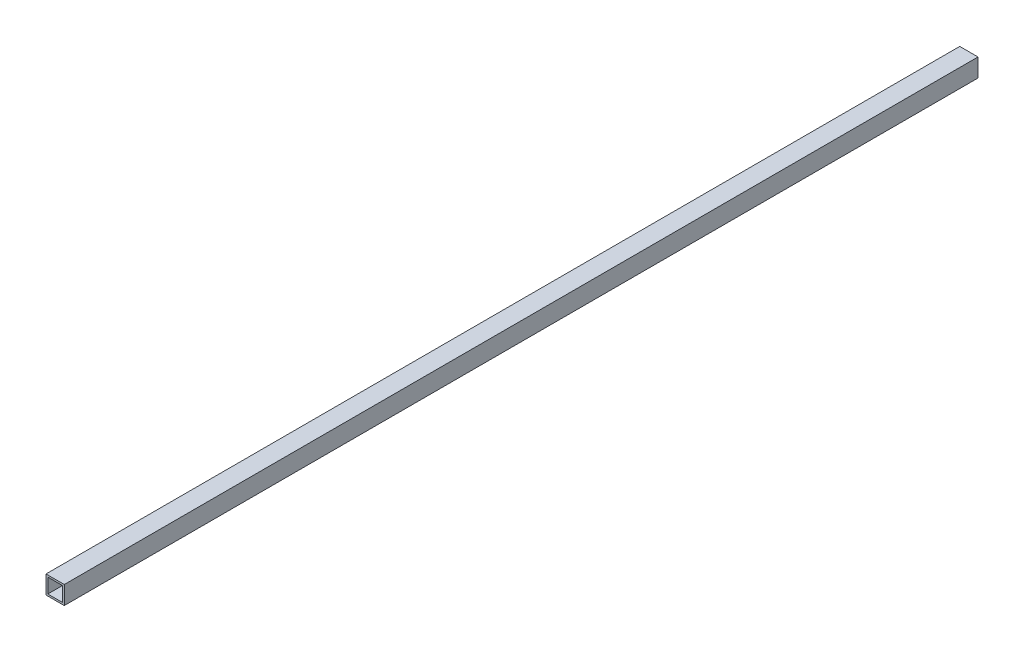
ISO-10303-21;
HEADER;
FILE_DESCRIPTION(('STEP AP214'),'2;1');
FILE_NAME('part.step','',(''),(''),'','','');
FILE_SCHEMA(('AUTOMOTIVE_DESIGN { 1 0 10303 214 1 1 1 1 }'));
ENDSEC;
DATA;
#1=APPLICATION_CONTEXT('core data for automotive mechanical design processes');
#2=APPLICATION_PROTOCOL_DEFINITION('international standard','automotive_design',2000,#1);
#3=PRODUCT_CONTEXT('',#1,'mechanical');
#4=PRODUCT('Part','Part','',(#3));
#5=PRODUCT_RELATED_PRODUCT_CATEGORY('part','',(#4));
#6=PRODUCT_DEFINITION_FORMATION('','',#4);
#7=PRODUCT_DEFINITION_CONTEXT('part definition',#1,'design');
#8=PRODUCT_DEFINITION('design','',#6,#7);
#9=PRODUCT_DEFINITION_SHAPE('','',#8);
#10=(LENGTH_UNIT() NAMED_UNIT(*) SI_UNIT(.MILLI.,.METRE.));
#11=(NAMED_UNIT(*) PLANE_ANGLE_UNIT() SI_UNIT($,.RADIAN.));
#12=(NAMED_UNIT(*) SI_UNIT($,.STERADIAN.) SOLID_ANGLE_UNIT());
#13=UNCERTAINTY_MEASURE_WITH_UNIT(LENGTH_MEASURE(1.E-05),#10,'distance_accuracy_value','');
#14=(GEOMETRIC_REPRESENTATION_CONTEXT(3) GLOBAL_UNCERTAINTY_ASSIGNED_CONTEXT((#13)) GLOBAL_UNIT_ASSIGNED_CONTEXT((#10,
#11,#12)) REPRESENTATION_CONTEXT('',''));
#15=CARTESIAN_POINT('',(0.,0.,0.));
#16=DIRECTION('',(0.,0.,1.));
#17=DIRECTION('',(1.,0.,0.));
#18=AXIS2_PLACEMENT_3D('',#15,#16,#17);
#19=CARTESIAN_POINT('',(0.,0.,-2000.));
#20=DIRECTION('',(-1.,0.,0.));
#21=DIRECTION('',(0.,0.,1.));
#22=AXIS2_PLACEMENT_3D('',#19,#20,#21);
#23=PLANE('',#22);
#24=DIRECTION('',(0.,-1.,0.));
#25=VECTOR('',#24,1.);
#26=CARTESIAN_POINT('',(0.,0.,0.));
#27=LINE('',#26,#25);
#28=CARTESIAN_POINT('',(0.,40.,0.));
#29=VERTEX_POINT('',#28);
#30=CARTESIAN_POINT('',(0.,0.,0.));
#31=VERTEX_POINT('',#30);
#32=EDGE_CURVE('E135',#29,#31,#27,.T.);
#33=ORIENTED_EDGE('',*,*,#32,.F.);
#34=DIRECTION('',(0.,0.,1.));
#35=VECTOR('',#34,1.);
#36=CARTESIAN_POINT('',(0.,40.,-2000.));
#37=LINE('',#36,#35);
#38=CARTESIAN_POINT('',(0.,40.,-2000.));
#39=VERTEX_POINT('',#38);
#40=EDGE_CURVE('E11',#39,#29,#37,.T.);
#41=ORIENTED_EDGE('',*,*,#40,.F.);
#42=DIRECTION('',(0.,-1.,0.));
#43=VECTOR('',#42,1.);
#44=CARTESIAN_POINT('',(0.,0.,-2000.));
#45=LINE('',#44,#43);
#46=CARTESIAN_POINT('',(0.,0.,-2000.));
#47=VERTEX_POINT('',#46);
#48=EDGE_CURVE('E139',#39,#47,#45,.T.);
#49=ORIENTED_EDGE('',*,*,#48,.T.);
#50=DIRECTION('',(0.,0.,1.));
#51=VECTOR('',#50,1.);
#52=CARTESIAN_POINT('',(0.,0.,-2000.));
#53=LINE('',#52,#51);
#54=EDGE_CURVE('E40',#47,#31,#53,.T.);
#55=ORIENTED_EDGE('',*,*,#54,.T.);
#56=EDGE_LOOP('',(#33,#41,#49,#55));
#57=FACE_BOUND('',#56,.T.);
#58=ADVANCED_FACE('F37',(#57),#23,.T.);
#59=CARTESIAN_POINT('',(0.,40.,-2000.));
#60=DIRECTION('',(0.,1.,0.));
#61=DIRECTION('',(0.,0.,1.));
#62=AXIS2_PLACEMENT_3D('',#59,#60,#61);
#63=PLANE('',#62);
#64=DIRECTION('',(-1.,0.,0.));
#65=VECTOR('',#64,1.);
#66=CARTESIAN_POINT('',(0.,40.,0.));
#67=LINE('',#66,#65);
#68=CARTESIAN_POINT('',(40.,40.,0.));
#69=VERTEX_POINT('',#68);
#70=EDGE_CURVE('E143',#69,#29,#67,.T.);
#71=ORIENTED_EDGE('',*,*,#70,.F.);
#72=DIRECTION('',(0.,0.,1.));
#73=VECTOR('',#72,1.);
#74=CARTESIAN_POINT('',(40.,40.,-2000.));
#75=LINE('',#74,#73);
#76=CARTESIAN_POINT('',(40.,40.,-2000.));
#77=VERTEX_POINT('',#76);
#78=EDGE_CURVE('E45',#77,#69,#75,.T.);
#79=ORIENTED_EDGE('',*,*,#78,.F.);
#80=DIRECTION('',(-1.,0.,0.));
#81=VECTOR('',#80,1.);
#82=CARTESIAN_POINT('',(0.,40.,-2000.));
#83=LINE('',#82,#81);
#84=EDGE_CURVE('E149',#77,#39,#83,.T.);
#85=ORIENTED_EDGE('',*,*,#84,.T.);
#86=ORIENTED_EDGE('',*,*,#40,.T.);
#87=EDGE_LOOP('',(#71,#79,#85,#86));
#88=FACE_BOUND('',#87,.T.);
#89=ADVANCED_FACE('F175',(#88),#63,.T.);
#90=CARTESIAN_POINT('',(40.,0.,-2000.));
#91=DIRECTION('',(1.,0.,0.));
#92=DIRECTION('',(0.,0.,-1.));
#93=AXIS2_PLACEMENT_3D('',#90,#91,#92);
#94=PLANE('',#93);
#95=DIRECTION('',(0.,1.,0.));
#96=VECTOR('',#95,1.);
#97=CARTESIAN_POINT('',(40.,0.,0.));
#98=LINE('',#97,#96);
#99=CARTESIAN_POINT('',(40.,0.,0.));
#100=VERTEX_POINT('',#99);
#101=EDGE_CURVE('E157',#100,#69,#98,.T.);
#102=ORIENTED_EDGE('',*,*,#101,.F.);
#103=DIRECTION('',(0.,0.,1.));
#104=VECTOR('',#103,1.);
#105=CARTESIAN_POINT('',(40.,0.,-2000.));
#106=LINE('',#105,#104);
#107=CARTESIAN_POINT('',(40.,0.,-2000.));
#108=VERTEX_POINT('',#107);
#109=EDGE_CURVE('E162',#108,#100,#106,.T.);
#110=ORIENTED_EDGE('',*,*,#109,.F.);
#111=DIRECTION('',(0.,1.,0.));
#112=VECTOR('',#111,1.);
#113=CARTESIAN_POINT('',(40.,0.,-2000.));
#114=LINE('',#113,#112);
#115=EDGE_CURVE('E146',#108,#77,#114,.T.);
#116=ORIENTED_EDGE('',*,*,#115,.T.);
#117=ORIENTED_EDGE('',*,*,#78,.T.);
#118=EDGE_LOOP('',(#102,#110,#116,#117));
#119=FACE_BOUND('',#118,.T.);
#120=ADVANCED_FACE('F179',(#119),#94,.T.);
#121=CARTESIAN_POINT('',(0.,0.,-2000.));
#122=DIRECTION('',(0.,-1.,0.));
#123=DIRECTION('',(0.,0.,-1.));
#124=AXIS2_PLACEMENT_3D('',#121,#122,#123);
#125=PLANE('',#124);
#126=DIRECTION('',(1.,0.,0.));
#127=VECTOR('',#126,1.);
#128=CARTESIAN_POINT('',(0.,0.,0.));
#129=LINE('',#128,#127);
#130=EDGE_CURVE('E154',#31,#100,#129,.T.);
#131=ORIENTED_EDGE('',*,*,#130,.F.);
#132=ORIENTED_EDGE('',*,*,#54,.F.);
#133=DIRECTION('',(1.,0.,0.));
#134=VECTOR('',#133,1.);
#135=CARTESIAN_POINT('',(0.,0.,-2000.));
#136=LINE('',#135,#134);
#137=EDGE_CURVE('E142',#47,#108,#136,.T.);
#138=ORIENTED_EDGE('',*,*,#137,.T.);
#139=ORIENTED_EDGE('',*,*,#109,.T.);
#140=EDGE_LOOP('',(#131,#132,#138,#139));
#141=FACE_BOUND('',#140,.T.);
#142=ADVANCED_FACE('F170',(#141),#125,.T.);
#143=CARTESIAN_POINT('',(0.,0.,-2000.));
#144=DIRECTION('',(0.,0.,-1.));
#145=DIRECTION('',(-1.,0.,0.));
#146=AXIS2_PLACEMENT_3D('',#143,#144,#145);
#147=PLANE('',#146);
#148=DIRECTION('',(0.,-1.,0.));
#149=VECTOR('',#148,1.);
#150=CARTESIAN_POINT('',(4.,4.,-2000.));
#151=LINE('',#150,#149);
#152=CARTESIAN_POINT('',(4.,36.,-2000.));
#153=VERTEX_POINT('',#152);
#154=CARTESIAN_POINT('',(4.,4.,-2000.));
#155=VERTEX_POINT('',#154);
#156=EDGE_CURVE('E104',#153,#155,#151,.T.);
#157=ORIENTED_EDGE('',*,*,#156,.T.);
#158=DIRECTION('',(1.,0.,0.));
#159=VECTOR('',#158,1.);
#160=CARTESIAN_POINT('',(4.,4.,-2000.));
#161=LINE('',#160,#159);
#162=CARTESIAN_POINT('',(36.,4.,-2000.));
#163=VERTEX_POINT('',#162);
#164=EDGE_CURVE('E113',#155,#163,#161,.T.);
#165=ORIENTED_EDGE('',*,*,#164,.T.);
#166=DIRECTION('',(0.,1.,0.));
#167=VECTOR('',#166,1.);
#168=CARTESIAN_POINT('',(36.,4.,-2000.));
#169=LINE('',#168,#167);
#170=CARTESIAN_POINT('',(36.,36.,-2000.));
#171=VERTEX_POINT('',#170);
#172=EDGE_CURVE('E53',#163,#171,#169,.T.);
#173=ORIENTED_EDGE('',*,*,#172,.T.);
#174=DIRECTION('',(-1.,0.,0.));
#175=VECTOR('',#174,1.);
#176=CARTESIAN_POINT('',(4.,36.,-2000.));
#177=LINE('',#176,#175);
#178=EDGE_CURVE('E110',#171,#153,#177,.T.);
#179=ORIENTED_EDGE('',*,*,#178,.T.);
#180=EDGE_LOOP('',(#157,#165,#173,#179));
#181=FACE_BOUND('',#180,.T.);
#182=ORIENTED_EDGE('',*,*,#48,.F.);
#183=ORIENTED_EDGE('',*,*,#84,.F.);
#184=ORIENTED_EDGE('',*,*,#115,.F.);
#185=ORIENTED_EDGE('',*,*,#137,.F.);
#186=EDGE_LOOP('',(#182,#183,#184,#185));
#187=FACE_BOUND('',#186,.T.);
#188=ADVANCED_FACE('F117',(#181,#187),#147,.T.);
#189=CARTESIAN_POINT('',(0.,0.,0.));
#190=DIRECTION('',(0.,0.,-1.));
#191=DIRECTION('',(-1.,0.,0.));
#192=AXIS2_PLACEMENT_3D('',#189,#190,#191);
#193=PLANE('',#192);
#194=DIRECTION('',(1.,0.,0.));
#195=VECTOR('',#194,1.);
#196=CARTESIAN_POINT('',(4.,4.,0.));
#197=LINE('',#196,#195);
#198=CARTESIAN_POINT('',(4.,4.,0.));
#199=VERTEX_POINT('',#198);
#200=CARTESIAN_POINT('',(36.,4.,0.));
#201=VERTEX_POINT('',#200);
#202=EDGE_CURVE('E129',#199,#201,#197,.T.);
#203=ORIENTED_EDGE('',*,*,#202,.F.);
#204=DIRECTION('',(0.,-1.,0.));
#205=VECTOR('',#204,1.);
#206=CARTESIAN_POINT('',(4.,4.,0.));
#207=LINE('',#206,#205);
#208=CARTESIAN_POINT('',(4.,36.,0.));
#209=VERTEX_POINT('',#208);
#210=EDGE_CURVE('E61',#209,#199,#207,.T.);
#211=ORIENTED_EDGE('',*,*,#210,.F.);
#212=DIRECTION('',(-1.,0.,0.));
#213=VECTOR('',#212,1.);
#214=CARTESIAN_POINT('',(4.,36.,0.));
#215=LINE('',#214,#213);
#216=CARTESIAN_POINT('',(36.,36.,0.));
#217=VERTEX_POINT('',#216);
#218=EDGE_CURVE('E120',#217,#209,#215,.T.);
#219=ORIENTED_EDGE('',*,*,#218,.F.);
#220=DIRECTION('',(0.,1.,0.));
#221=VECTOR('',#220,1.);
#222=CARTESIAN_POINT('',(36.,4.,0.));
#223=LINE('',#222,#221);
#224=EDGE_CURVE('E123',#201,#217,#223,.T.);
#225=ORIENTED_EDGE('',*,*,#224,.F.);
#226=EDGE_LOOP('',(#203,#211,#219,#225));
#227=FACE_BOUND('',#226,.T.);
#228=ORIENTED_EDGE('',*,*,#32,.T.);
#229=ORIENTED_EDGE('',*,*,#130,.T.);
#230=ORIENTED_EDGE('',*,*,#101,.T.);
#231=ORIENTED_EDGE('',*,*,#70,.T.);
#232=EDGE_LOOP('',(#228,#229,#230,#231));
#233=FACE_BOUND('',#232,.T.);
#234=ADVANCED_FACE('F172',(#227,#233),#193,.F.);
#235=CARTESIAN_POINT('',(4.,4.,-2000.));
#236=DIRECTION('',(-1.,0.,0.));
#237=DIRECTION('',(0.,0.,1.));
#238=AXIS2_PLACEMENT_3D('',#235,#236,#237);
#239=PLANE('',#238);
#240=ORIENTED_EDGE('',*,*,#210,.T.);
#241=DIRECTION('',(0.,0.,1.));
#242=VECTOR('',#241,1.);
#243=CARTESIAN_POINT('',(4.,4.,-2000.));
#244=LINE('',#243,#242);
#245=EDGE_CURVE('E100',#155,#199,#244,.T.);
#246=ORIENTED_EDGE('',*,*,#245,.F.);
#247=ORIENTED_EDGE('',*,*,#156,.F.);
#248=DIRECTION('',(0.,0.,1.));
#249=VECTOR('',#248,1.);
#250=CARTESIAN_POINT('',(4.,36.,-2000.));
#251=LINE('',#250,#249);
#252=EDGE_CURVE('E133',#153,#209,#251,.T.);
#253=ORIENTED_EDGE('',*,*,#252,.T.);
#254=EDGE_LOOP('',(#240,#246,#247,#253));
#255=FACE_BOUND('',#254,.T.);
#256=ADVANCED_FACE('F102',(#255),#239,.F.);
#257=CARTESIAN_POINT('',(4.,36.,-2000.));
#258=DIRECTION('',(0.,1.,0.));
#259=DIRECTION('',(0.,0.,1.));
#260=AXIS2_PLACEMENT_3D('',#257,#258,#259);
#261=PLANE('',#260);
#262=ORIENTED_EDGE('',*,*,#218,.T.);
#263=ORIENTED_EDGE('',*,*,#252,.F.);
#264=ORIENTED_EDGE('',*,*,#178,.F.);
#265=DIRECTION('',(0.,0.,1.));
#266=VECTOR('',#265,1.);
#267=CARTESIAN_POINT('',(36.,36.,-2000.));
#268=LINE('',#267,#266);
#269=EDGE_CURVE('E136',#171,#217,#268,.T.);
#270=ORIENTED_EDGE('',*,*,#269,.T.);
#271=EDGE_LOOP('',(#262,#263,#264,#270));
#272=FACE_BOUND('',#271,.T.);
#273=ADVANCED_FACE('F235',(#272),#261,.F.);
#274=CARTESIAN_POINT('',(36.,4.,-2000.));
#275=DIRECTION('',(1.,0.,0.));
#276=DIRECTION('',(0.,0.,-1.));
#277=AXIS2_PLACEMENT_3D('',#274,#275,#276);
#278=PLANE('',#277);
#279=ORIENTED_EDGE('',*,*,#224,.T.);
#280=ORIENTED_EDGE('',*,*,#269,.F.);
#281=ORIENTED_EDGE('',*,*,#172,.F.);
#282=DIRECTION('',(0.,0.,1.));
#283=VECTOR('',#282,1.);
#284=CARTESIAN_POINT('',(36.,4.,-2000.));
#285=LINE('',#284,#283);
#286=EDGE_CURVE('E109',#163,#201,#285,.T.);
#287=ORIENTED_EDGE('',*,*,#286,.T.);
#288=EDGE_LOOP('',(#279,#280,#281,#287));
#289=FACE_BOUND('',#288,.T.);
#290=ADVANCED_FACE('F245',(#289),#278,.F.);
#291=CARTESIAN_POINT('',(4.,4.,-2000.));
#292=DIRECTION('',(0.,-1.,0.));
#293=DIRECTION('',(0.,0.,-1.));
#294=AXIS2_PLACEMENT_3D('',#291,#292,#293);
#295=PLANE('',#294);
#296=ORIENTED_EDGE('',*,*,#202,.T.);
#297=ORIENTED_EDGE('',*,*,#286,.F.);
#298=ORIENTED_EDGE('',*,*,#164,.F.);
#299=ORIENTED_EDGE('',*,*,#245,.T.);
#300=EDGE_LOOP('',(#296,#297,#298,#299));
#301=FACE_BOUND('',#300,.T.);
#302=ADVANCED_FACE('F114',(#301),#295,.F.);
#303=CLOSED_SHELL('',(#58,#89,#120,#142,#188,#234,#256,#273,#290,#302));
#304=MANIFOLD_SOLID_BREP('B2',#303);
#305=ADVANCED_BREP_SHAPE_REPRESENTATION('',(#18,#304),#14);
#306=SHAPE_DEFINITION_REPRESENTATION(#9,#305);
ENDSEC;
END-ISO-10303-21;
